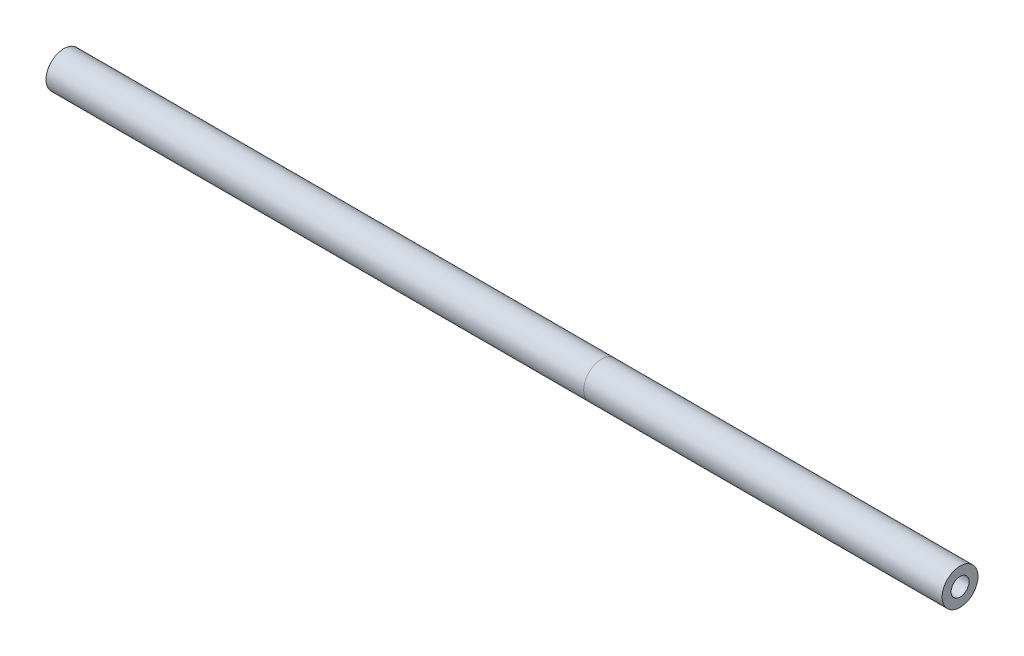
ISO-10303-21;
HEADER;
FILE_DESCRIPTION(('STEP AP214'),'2;1');
FILE_NAME('part.step','',(''),(''),'','','');
FILE_SCHEMA(('AUTOMOTIVE_DESIGN { 1 0 10303 214 1 1 1 1 }'));
ENDSEC;
DATA;
#1=APPLICATION_CONTEXT('core data for automotive mechanical design processes');
#2=APPLICATION_PROTOCOL_DEFINITION('international standard','automotive_design',2000,#1);
#3=PRODUCT_CONTEXT('',#1,'mechanical');
#4=PRODUCT('Part','Part','',(#3));
#5=PRODUCT_RELATED_PRODUCT_CATEGORY('part','',(#4));
#6=PRODUCT_DEFINITION_FORMATION('','',#4);
#7=PRODUCT_DEFINITION_CONTEXT('part definition',#1,'design');
#8=PRODUCT_DEFINITION('design','',#6,#7);
#9=PRODUCT_DEFINITION_SHAPE('','',#8);
#10=(LENGTH_UNIT() NAMED_UNIT(*) SI_UNIT(.MILLI.,.METRE.));
#11=(NAMED_UNIT(*) PLANE_ANGLE_UNIT() SI_UNIT($,.RADIAN.));
#12=(NAMED_UNIT(*) SI_UNIT($,.STERADIAN.) SOLID_ANGLE_UNIT());
#13=UNCERTAINTY_MEASURE_WITH_UNIT(LENGTH_MEASURE(1.E-05),#10,'distance_accuracy_value','');
#14=(GEOMETRIC_REPRESENTATION_CONTEXT(3) GLOBAL_UNCERTAINTY_ASSIGNED_CONTEXT((#13)) GLOBAL_UNIT_ASSIGNED_CONTEXT((#10,
#11,#12)) REPRESENTATION_CONTEXT('',''));
#15=CARTESIAN_POINT('',(0.,0.,0.));
#16=DIRECTION('',(0.,0.,1.));
#17=DIRECTION('',(1.,0.,0.));
#18=AXIS2_PLACEMENT_3D('',#15,#16,#17);
#19=CARTESIAN_POINT('',(1000.,0.,0.));
#20=DIRECTION('',(-1.,0.,0.));
#21=DIRECTION('',(0.,0.,1.));
#22=AXIS2_PLACEMENT_3D('',#19,#20,#21);
#23=CYLINDRICAL_SURFACE('',#22,10.);
#24=CARTESIAN_POINT('',(1000.,0.,0.));
#25=DIRECTION('',(1.,0.,0.));
#26=DIRECTION('',(0.,0.,-1.));
#27=AXIS2_PLACEMENT_3D('',#24,#25,#26);
#28=CIRCLE('',#27,10.);
#29=CARTESIAN_POINT('',(1000.,0.,-10.));
#30=VERTEX_POINT('',#29);
#31=EDGE_CURVE('E58',#30,#30,#28,.T.);
#32=ORIENTED_EDGE('',*,*,#31,.T.);
#33=EDGE_LOOP('',(#32));
#34=FACE_BOUND('',#33,.T.);
#35=CARTESIAN_POINT('',(600.,0.,0.));
#36=DIRECTION('',(1.,0.,0.));
#37=DIRECTION('',(0.,0.,-1.));
#38=AXIS2_PLACEMENT_3D('',#35,#36,#37);
#39=CIRCLE('',#38,10.);
#40=CARTESIAN_POINT('',(600.,0.,-10.));
#41=VERTEX_POINT('',#40);
#42=EDGE_CURVE('E64',#41,#41,#39,.T.);
#43=ORIENTED_EDGE('',*,*,#42,.F.);
#44=EDGE_LOOP('',(#43));
#45=FACE_BOUND('',#44,.T.);
#46=ADVANCED_FACE('F51',(#34,#45),#23,.F.);
#47=CARTESIAN_POINT('',(1000.,0.,0.));
#48=DIRECTION('',(-1.,0.,0.));
#49=DIRECTION('',(0.,0.,1.));
#50=AXIS2_PLACEMENT_3D('',#47,#48,#49);
#51=CYLINDRICAL_SURFACE('',#50,20.);
#52=CARTESIAN_POINT('',(1000.,0.,0.));
#53=DIRECTION('',(1.,0.,0.));
#54=DIRECTION('',(0.,0.,-1.));
#55=AXIS2_PLACEMENT_3D('',#52,#53,#54);
#56=CIRCLE('',#55,20.);
#57=CARTESIAN_POINT('',(1000.,0.,-20.));
#58=VERTEX_POINT('',#57);
#59=EDGE_CURVE('E12',#58,#58,#56,.T.);
#60=ORIENTED_EDGE('',*,*,#59,.F.);
#61=EDGE_LOOP('',(#60));
#62=FACE_BOUND('',#61,.T.);
#63=CARTESIAN_POINT('',(600.,0.,0.));
#64=DIRECTION('',(1.,0.,0.));
#65=DIRECTION('',(0.,0.,-1.));
#66=AXIS2_PLACEMENT_3D('',#63,#64,#65);
#67=CIRCLE('',#66,20.);
#68=CARTESIAN_POINT('',(600.,0.,-20.));
#69=VERTEX_POINT('',#68);
#70=EDGE_CURVE('E54',#69,#69,#67,.T.);
#71=ORIENTED_EDGE('',*,*,#70,.T.);
#72=EDGE_LOOP('',(#71));
#73=FACE_BOUND('',#72,.T.);
#74=ADVANCED_FACE('F71',(#62,#73),#51,.T.);
#75=CARTESIAN_POINT('',(1000.,0.,0.));
#76=DIRECTION('',(1.,0.,0.));
#77=DIRECTION('',(0.,0.,-1.));
#78=AXIS2_PLACEMENT_3D('',#75,#76,#77);
#79=PLANE('',#78);
#80=ORIENTED_EDGE('',*,*,#31,.F.);
#81=EDGE_LOOP('',(#80));
#82=FACE_BOUND('',#81,.T.);
#83=ORIENTED_EDGE('',*,*,#59,.T.);
#84=EDGE_LOOP('',(#83));
#85=FACE_BOUND('',#84,.T.);
#86=ADVANCED_FACE('F75',(#82,#85),#79,.T.);
#87=CARTESIAN_POINT('',(600.,0.,0.));
#88=DIRECTION('',(1.,0.,0.));
#89=DIRECTION('',(0.,0.,-1.));
#90=AXIS2_PLACEMENT_3D('',#87,#88,#89);
#91=PLANE('',#90);
#92=ORIENTED_EDGE('',*,*,#42,.T.);
#93=EDGE_LOOP('',(#92));
#94=FACE_BOUND('',#93,.T.);
#95=ORIENTED_EDGE('',*,*,#70,.F.);
#96=EDGE_LOOP('',(#95));
#97=FACE_BOUND('',#96,.T.);
#98=ADVANCED_FACE('F73',(#94,#97),#91,.F.);
#99=CLOSED_SHELL('',(#46,#74,#86,#98));
#100=MANIFOLD_SOLID_BREP('B2',#99);
#101=CARTESIAN_POINT('',(600.,0.,0.));
#102=DIRECTION('',(-1.,0.,0.));
#103=DIRECTION('',(0.,0.,1.));
#104=AXIS2_PLACEMENT_3D('',#101,#102,#103);
#105=CYLINDRICAL_SURFACE('',#104,10.);
#106=CARTESIAN_POINT('',(600.,0.,0.));
#107=DIRECTION('',(1.,0.,0.));
#108=DIRECTION('',(0.,0.,-1.));
#109=AXIS2_PLACEMENT_3D('',#106,#107,#108);
#110=CIRCLE('',#109,10.);
#111=CARTESIAN_POINT('',(600.,0.,-10.));
#112=VERTEX_POINT('',#111);
#113=EDGE_CURVE('E127',#112,#112,#110,.T.);
#114=ORIENTED_EDGE('',*,*,#113,.T.);
#115=EDGE_LOOP('',(#114));
#116=FACE_BOUND('',#115,.T.);
#117=CARTESIAN_POINT('',(0.,0.,0.));
#118=DIRECTION('',(1.,0.,0.));
#119=DIRECTION('',(0.,0.,-1.));
#120=AXIS2_PLACEMENT_3D('',#117,#118,#119);
#121=CIRCLE('',#120,10.);
#122=CARTESIAN_POINT('',(0.,0.,-10.));
#123=VERTEX_POINT('',#122);
#124=EDGE_CURVE('E133',#123,#123,#121,.T.);
#125=ORIENTED_EDGE('',*,*,#124,.F.);
#126=EDGE_LOOP('',(#125));
#127=FACE_BOUND('',#126,.T.);
#128=ADVANCED_FACE('F120',(#116,#127),#105,.F.);
#129=CARTESIAN_POINT('',(600.,0.,0.));
#130=DIRECTION('',(-1.,0.,0.));
#131=DIRECTION('',(0.,0.,1.));
#132=AXIS2_PLACEMENT_3D('',#129,#130,#131);
#133=CYLINDRICAL_SURFACE('',#132,20.);
#134=CARTESIAN_POINT('',(600.,0.,0.));
#135=DIRECTION('',(1.,0.,0.));
#136=DIRECTION('',(0.,0.,-1.));
#137=AXIS2_PLACEMENT_3D('',#134,#135,#136);
#138=CIRCLE('',#137,20.);
#139=CARTESIAN_POINT('',(600.,0.,-20.));
#140=VERTEX_POINT('',#139);
#141=EDGE_CURVE('E50',#140,#140,#138,.T.);
#142=ORIENTED_EDGE('',*,*,#141,.F.);
#143=EDGE_LOOP('',(#142));
#144=FACE_BOUND('',#143,.T.);
#145=CARTESIAN_POINT('',(0.,0.,0.));
#146=DIRECTION('',(1.,0.,0.));
#147=DIRECTION('',(0.,0.,-1.));
#148=AXIS2_PLACEMENT_3D('',#145,#146,#147);
#149=CIRCLE('',#148,20.);
#150=CARTESIAN_POINT('',(0.,0.,-20.));
#151=VERTEX_POINT('',#150);
#152=EDGE_CURVE('E123',#151,#151,#149,.T.);
#153=ORIENTED_EDGE('',*,*,#152,.T.);
#154=EDGE_LOOP('',(#153));
#155=FACE_BOUND('',#154,.T.);
#156=ADVANCED_FACE('F140',(#144,#155),#133,.T.);
#157=CARTESIAN_POINT('',(600.,0.,0.));
#158=DIRECTION('',(1.,0.,0.));
#159=DIRECTION('',(0.,0.,-1.));
#160=AXIS2_PLACEMENT_3D('',#157,#158,#159);
#161=PLANE('',#160);
#162=ORIENTED_EDGE('',*,*,#113,.F.);
#163=EDGE_LOOP('',(#162));
#164=FACE_BOUND('',#163,.T.);
#165=ORIENTED_EDGE('',*,*,#141,.T.);
#166=EDGE_LOOP('',(#165));
#167=FACE_BOUND('',#166,.T.);
#168=ADVANCED_FACE('F144',(#164,#167),#161,.T.);
#169=CARTESIAN_POINT('',(0.,0.,0.));
#170=DIRECTION('',(1.,0.,0.));
#171=DIRECTION('',(0.,0.,-1.));
#172=AXIS2_PLACEMENT_3D('',#169,#170,#171);
#173=PLANE('',#172);
#174=ORIENTED_EDGE('',*,*,#124,.T.);
#175=EDGE_LOOP('',(#174));
#176=FACE_BOUND('',#175,.T.);
#177=ORIENTED_EDGE('',*,*,#152,.F.);
#178=EDGE_LOOP('',(#177));
#179=FACE_BOUND('',#178,.T.);
#180=ADVANCED_FACE('F142',(#176,#179),#173,.F.);
#181=CLOSED_SHELL('',(#128,#156,#168,#180));
#182=MANIFOLD_SOLID_BREP('B7',#181);
#183=ADVANCED_BREP_SHAPE_REPRESENTATION('',(#18,#100,#182),#14);
#184=SHAPE_DEFINITION_REPRESENTATION(#9,#183);
ENDSEC;
END-ISO-10303-21;
